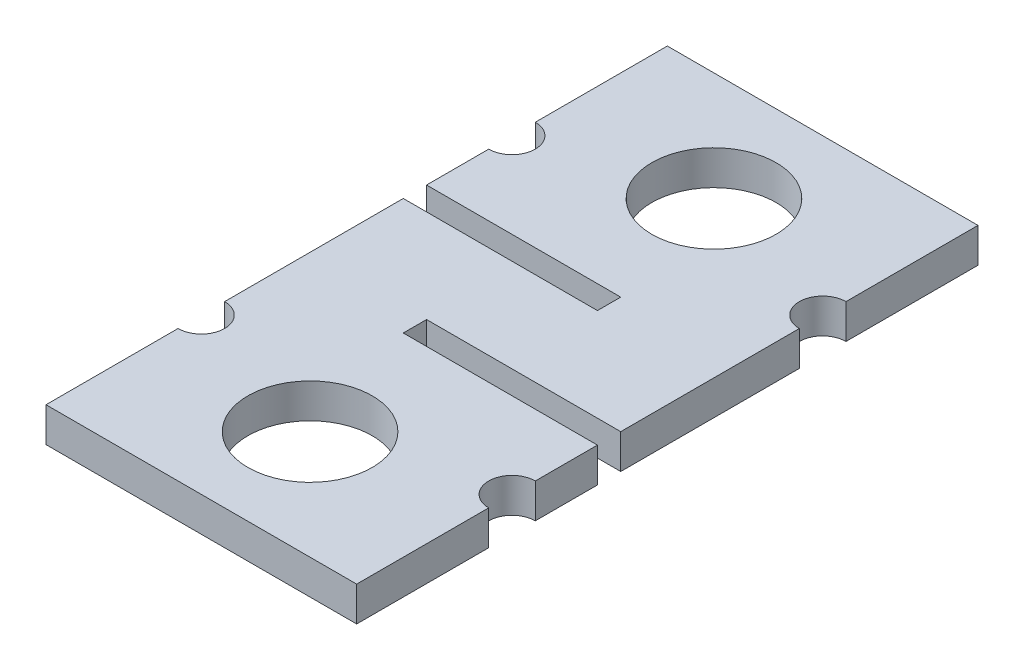
ISO-10303-21;
HEADER;
FILE_DESCRIPTION(('STEP AP214'),'2;1');
FILE_NAME('part.step','',(''),(''),'','','');
FILE_SCHEMA(('AUTOMOTIVE_DESIGN { 1 0 10303 214 1 1 1 1 }'));
ENDSEC;
DATA;
#1=APPLICATION_CONTEXT('core data for automotive mechanical design processes');
#2=APPLICATION_PROTOCOL_DEFINITION('international standard','automotive_design',2000,#1);
#3=PRODUCT_CONTEXT('',#1,'mechanical');
#4=PRODUCT('Part','Part','',(#3));
#5=PRODUCT_RELATED_PRODUCT_CATEGORY('part','',(#4));
#6=PRODUCT_DEFINITION_FORMATION('','',#4);
#7=PRODUCT_DEFINITION_CONTEXT('part definition',#1,'design');
#8=PRODUCT_DEFINITION('design','',#6,#7);
#9=PRODUCT_DEFINITION_SHAPE('','',#8);
#10=(LENGTH_UNIT() NAMED_UNIT(*) SI_UNIT(.MILLI.,.METRE.));
#11=(NAMED_UNIT(*) PLANE_ANGLE_UNIT() SI_UNIT($,.RADIAN.));
#12=(NAMED_UNIT(*) SI_UNIT($,.STERADIAN.) SOLID_ANGLE_UNIT());
#13=UNCERTAINTY_MEASURE_WITH_UNIT(LENGTH_MEASURE(1.E-05),#10,'distance_accuracy_value','');
#14=(GEOMETRIC_REPRESENTATION_CONTEXT(3) GLOBAL_UNCERTAINTY_ASSIGNED_CONTEXT((#13)) GLOBAL_UNIT_ASSIGNED_CONTEXT((#10,
#11,#12)) REPRESENTATION_CONTEXT('',''));
#15=CARTESIAN_POINT('',(0.,0.,0.));
#16=DIRECTION('',(0.,0.,1.));
#17=DIRECTION('',(1.,0.,0.));
#18=AXIS2_PLACEMENT_3D('',#15,#16,#17);
#19=CARTESIAN_POINT('',(-20.,4.45,-18.75));
#20=DIRECTION('',(0.,1.,0.));
#21=DIRECTION('',(0.,0.,1.));
#22=AXIS2_PLACEMENT_3D('',#19,#20,#21);
#23=PLANE('',#22);
#24=CARTESIAN_POINT('',(0.,4.45,27.25));
#25=DIRECTION('',(0.,1.,0.));
#26=DIRECTION('',(0.,0.,1.));
#27=AXIS2_PLACEMENT_3D('',#24,#25,#26);
#28=CIRCLE('',#27,8.);
#29=CARTESIAN_POINT('',(0.,4.45,35.25));
#30=VERTEX_POINT('',#29);
#31=EDGE_CURVE('E205',#30,#30,#28,.T.);
#32=ORIENTED_EDGE('',*,*,#31,.F.);
#33=EDGE_LOOP('',(#32));
#34=FACE_BOUND('',#33,.T.);
#35=CARTESIAN_POINT('',(-20.,4.45,-18.75));
#36=DIRECTION('',(0.,-1.,0.));
#37=DIRECTION('',(0.,0.,1.));
#38=AXIS2_PLACEMENT_3D('',#35,#36,#37);
#39=CIRCLE('',#38,3.);
#40=CARTESIAN_POINT('',(-20.,4.45,-21.75));
#41=VERTEX_POINT('',#40);
#42=CARTESIAN_POINT('',(-20.,4.45,-15.75));
#43=VERTEX_POINT('',#42);
#44=EDGE_CURVE('E240',#41,#43,#39,.T.);
#45=ORIENTED_EDGE('',*,*,#44,.T.);
#46=DIRECTION('',(0.,0.,1.));
#47=VECTOR('',#46,1.);
#48=CARTESIAN_POINT('',(-20.,4.45,-7.75));
#49=LINE('',#48,#47);
#50=CARTESIAN_POINT('',(-20.,4.45,-7.75));
#51=VERTEX_POINT('',#50);
#52=EDGE_CURVE('E128',#43,#51,#49,.T.);
#53=ORIENTED_EDGE('',*,*,#52,.T.);
#54=DIRECTION('',(1.,0.,0.));
#55=VECTOR('',#54,1.);
#56=CARTESIAN_POINT('',(-20.,4.45,-7.75));
#57=LINE('',#56,#55);
#58=CARTESIAN_POINT('',(5.,4.45,-7.75));
#59=VERTEX_POINT('',#58);
#60=EDGE_CURVE('E291',#51,#59,#57,.T.);
#61=ORIENTED_EDGE('',*,*,#60,.T.);
#62=DIRECTION('',(0.,0.,1.));
#63=VECTOR('',#62,1.);
#64=CARTESIAN_POINT('',(5.,4.45,-7.75));
#65=LINE('',#64,#63);
#66=CARTESIAN_POINT('',(5.,4.45,-4.75));
#67=VERTEX_POINT('',#66);
#68=EDGE_CURVE('E310',#59,#67,#65,.T.);
#69=ORIENTED_EDGE('',*,*,#68,.T.);
#70=DIRECTION('',(-1.,0.,0.));
#71=VECTOR('',#70,1.);
#72=CARTESIAN_POINT('',(-20.,4.45,-4.75));
#73=LINE('',#72,#71);
#74=CARTESIAN_POINT('',(-20.,4.45,-4.75));
#75=VERTEX_POINT('',#74);
#76=EDGE_CURVE('E307',#67,#75,#73,.T.);
#77=ORIENTED_EDGE('',*,*,#76,.T.);
#78=DIRECTION('',(0.,0.,1.));
#79=VECTOR('',#78,1.);
#80=CARTESIAN_POINT('',(-20.,4.45,18.25));
#81=LINE('',#80,#79);
#82=CARTESIAN_POINT('',(-20.,4.45,18.25));
#83=VERTEX_POINT('',#82);
#84=EDGE_CURVE('E309',#75,#83,#81,.T.);
#85=ORIENTED_EDGE('',*,*,#84,.T.);
#86=CARTESIAN_POINT('',(-20.,4.45,21.25));
#87=DIRECTION('',(0.,-1.,0.));
#88=DIRECTION('',(0.,0.,1.));
#89=AXIS2_PLACEMENT_3D('',#86,#87,#88);
#90=CIRCLE('',#89,3.);
#91=CARTESIAN_POINT('',(-20.,4.45,24.25));
#92=VERTEX_POINT('',#91);
#93=EDGE_CURVE('E312',#83,#92,#90,.T.);
#94=ORIENTED_EDGE('',*,*,#93,.T.);
#95=DIRECTION('',(0.,0.,1.));
#96=VECTOR('',#95,1.);
#97=CARTESIAN_POINT('',(-20.,4.45,41.25));
#98=LINE('',#97,#96);
#99=CARTESIAN_POINT('',(-20.,4.45,41.25));
#100=VERTEX_POINT('',#99);
#101=EDGE_CURVE('E318',#92,#100,#98,.T.);
#102=ORIENTED_EDGE('',*,*,#101,.T.);
#103=DIRECTION('',(1.,0.,0.));
#104=VECTOR('',#103,1.);
#105=CARTESIAN_POINT('',(-20.,4.45,41.25));
#106=LINE('',#105,#104);
#107=CARTESIAN_POINT('',(20.,4.45,41.25));
#108=VERTEX_POINT('',#107);
#109=EDGE_CURVE('E320',#100,#108,#106,.T.);
#110=ORIENTED_EDGE('',*,*,#109,.T.);
#111=DIRECTION('',(0.,0.,-1.));
#112=VECTOR('',#111,1.);
#113=CARTESIAN_POINT('',(20.,4.45,41.25));
#114=LINE('',#113,#112);
#115=CARTESIAN_POINT('',(20.,4.45,24.25));
#116=VERTEX_POINT('',#115);
#117=EDGE_CURVE('E322',#108,#116,#114,.T.);
#118=ORIENTED_EDGE('',*,*,#117,.T.);
#119=CARTESIAN_POINT('',(20.,4.45,21.25));
#120=DIRECTION('',(0.,-1.,0.));
#121=DIRECTION('',(0.,0.,1.));
#122=AXIS2_PLACEMENT_3D('',#119,#120,#121);
#123=CIRCLE('',#122,3.);
#124=CARTESIAN_POINT('',(20.,4.45,18.25));
#125=VERTEX_POINT('',#124);
#126=EDGE_CURVE('E324',#116,#125,#123,.T.);
#127=ORIENTED_EDGE('',*,*,#126,.T.);
#128=DIRECTION('',(0.,0.,-1.));
#129=VECTOR('',#128,1.);
#130=CARTESIAN_POINT('',(20.,4.45,18.25));
#131=LINE('',#130,#129);
#132=CARTESIAN_POINT('',(20.,4.45,10.25));
#133=VERTEX_POINT('',#132);
#134=EDGE_CURVE('E326',#125,#133,#131,.T.);
#135=ORIENTED_EDGE('',*,*,#134,.T.);
#136=DIRECTION('',(-1.,0.,0.));
#137=VECTOR('',#136,1.);
#138=CARTESIAN_POINT('',(20.,4.45,10.25));
#139=LINE('',#138,#137);
#140=CARTESIAN_POINT('',(-5.,4.45,10.25));
#141=VERTEX_POINT('',#140);
#142=EDGE_CURVE('E328',#133,#141,#139,.T.);
#143=ORIENTED_EDGE('',*,*,#142,.T.);
#144=DIRECTION('',(0.,0.,-1.));
#145=VECTOR('',#144,1.);
#146=CARTESIAN_POINT('',(-5.,4.45,10.25));
#147=LINE('',#146,#145);
#148=CARTESIAN_POINT('',(-5.,4.45,7.25));
#149=VERTEX_POINT('',#148);
#150=EDGE_CURVE('E330',#141,#149,#147,.T.);
#151=ORIENTED_EDGE('',*,*,#150,.T.);
#152=DIRECTION('',(1.,0.,0.));
#153=VECTOR('',#152,1.);
#154=CARTESIAN_POINT('',(20.,4.45,7.25));
#155=LINE('',#154,#153);
#156=CARTESIAN_POINT('',(20.,4.45,7.25));
#157=VERTEX_POINT('',#156);
#158=EDGE_CURVE('E332',#149,#157,#155,.T.);
#159=ORIENTED_EDGE('',*,*,#158,.T.);
#160=DIRECTION('',(0.,0.,-1.));
#161=VECTOR('',#160,1.);
#162=CARTESIAN_POINT('',(20.,4.45,7.25));
#163=LINE('',#162,#161);
#164=CARTESIAN_POINT('',(20.,4.45,-15.75));
#165=VERTEX_POINT('',#164);
#166=EDGE_CURVE('E334',#157,#165,#163,.T.);
#167=ORIENTED_EDGE('',*,*,#166,.T.);
#168=CARTESIAN_POINT('',(20.,4.45,-18.75));
#169=DIRECTION('',(0.,-1.,0.));
#170=DIRECTION('',(0.,0.,1.));
#171=AXIS2_PLACEMENT_3D('',#168,#169,#170);
#172=CIRCLE('',#171,3.);
#173=CARTESIAN_POINT('',(20.,4.45,-21.75));
#174=VERTEX_POINT('',#173);
#175=EDGE_CURVE('E183',#165,#174,#172,.T.);
#176=ORIENTED_EDGE('',*,*,#175,.T.);
#177=DIRECTION('',(0.,0.,-1.));
#178=VECTOR('',#177,1.);
#179=CARTESIAN_POINT('',(20.,4.45,-21.75));
#180=LINE('',#179,#178);
#181=CARTESIAN_POINT('',(20.,4.45,-38.75));
#182=VERTEX_POINT('',#181);
#183=EDGE_CURVE('E177',#174,#182,#180,.T.);
#184=ORIENTED_EDGE('',*,*,#183,.T.);
#185=DIRECTION('',(-1.,0.,0.));
#186=VECTOR('',#185,1.);
#187=CARTESIAN_POINT('',(-20.,4.45,-38.75));
#188=LINE('',#187,#186);
#189=CARTESIAN_POINT('',(-20.,4.45,-38.75));
#190=VERTEX_POINT('',#189);
#191=EDGE_CURVE('E181',#182,#190,#188,.T.);
#192=ORIENTED_EDGE('',*,*,#191,.T.);
#193=DIRECTION('',(0.,0.,1.));
#194=VECTOR('',#193,1.);
#195=CARTESIAN_POINT('',(-20.,4.45,-21.75));
#196=LINE('',#195,#194);
#197=EDGE_CURVE('E49',#190,#41,#196,.T.);
#198=ORIENTED_EDGE('',*,*,#197,.T.);
#199=EDGE_LOOP('',(#45,#53,#61,#69,#77,#85,#94,#102,#110,#118,#127,#135,#143,#151,#159,#167,
#176,#184,#192,#198));
#200=FACE_BOUND('',#199,.T.);
#201=CARTESIAN_POINT('',(0.,4.45,-24.75));
#202=DIRECTION('',(0.,1.,0.));
#203=DIRECTION('',(0.,0.,1.));
#204=AXIS2_PLACEMENT_3D('',#201,#202,#203);
#205=CIRCLE('',#204,8.00000000000001);
#206=CARTESIAN_POINT('',(0.,4.45,-16.75));
#207=VERTEX_POINT('',#206);
#208=EDGE_CURVE('E376',#207,#207,#205,.T.);
#209=ORIENTED_EDGE('',*,*,#208,.F.);
#210=EDGE_LOOP('',(#209));
#211=FACE_BOUND('',#210,.T.);
#212=ADVANCED_FACE('F32',(#34,#200,#211),#23,.T.);
#213=CARTESIAN_POINT('',(-20.,0.,-18.75));
#214=DIRECTION('',(0.,1.,0.));
#215=DIRECTION('',(0.,0.,1.));
#216=AXIS2_PLACEMENT_3D('',#213,#214,#215);
#217=PLANE('',#216);
#218=CARTESIAN_POINT('',(-20.,0.,-18.75));
#219=DIRECTION('',(0.,-1.,0.));
#220=DIRECTION('',(0.,0.,1.));
#221=AXIS2_PLACEMENT_3D('',#218,#219,#220);
#222=CIRCLE('',#221,3.);
#223=CARTESIAN_POINT('',(-20.,0.,-21.75));
#224=VERTEX_POINT('',#223);
#225=CARTESIAN_POINT('',(-20.,0.,-15.75));
#226=VERTEX_POINT('',#225);
#227=EDGE_CURVE('E201',#224,#226,#222,.T.);
#228=ORIENTED_EDGE('',*,*,#227,.F.);
#229=DIRECTION('',(0.,0.,1.));
#230=VECTOR('',#229,1.);
#231=CARTESIAN_POINT('',(-20.,0.,-21.75));
#232=LINE('',#231,#230);
#233=CARTESIAN_POINT('',(-20.,0.,-38.75));
#234=VERTEX_POINT('',#233);
#235=EDGE_CURVE('E120',#234,#224,#232,.T.);
#236=ORIENTED_EDGE('',*,*,#235,.F.);
#237=DIRECTION('',(-1.,0.,0.));
#238=VECTOR('',#237,1.);
#239=CARTESIAN_POINT('',(-20.,0.,-38.75));
#240=LINE('',#239,#238);
#241=CARTESIAN_POINT('',(20.,0.,-38.75));
#242=VERTEX_POINT('',#241);
#243=EDGE_CURVE('E114',#242,#234,#240,.T.);
#244=ORIENTED_EDGE('',*,*,#243,.F.);
#245=DIRECTION('',(0.,0.,-1.));
#246=VECTOR('',#245,1.);
#247=CARTESIAN_POINT('',(20.,0.,-21.75));
#248=LINE('',#247,#246);
#249=CARTESIAN_POINT('',(20.,0.,-21.75));
#250=VERTEX_POINT('',#249);
#251=EDGE_CURVE('E191',#250,#242,#248,.T.);
#252=ORIENTED_EDGE('',*,*,#251,.F.);
#253=CARTESIAN_POINT('',(20.,0.,-18.75));
#254=DIRECTION('',(0.,-1.,0.));
#255=DIRECTION('',(0.,0.,1.));
#256=AXIS2_PLACEMENT_3D('',#253,#254,#255);
#257=CIRCLE('',#256,3.);
#258=CARTESIAN_POINT('',(20.,0.,-15.75));
#259=VERTEX_POINT('',#258);
#260=EDGE_CURVE('E235',#259,#250,#257,.T.);
#261=ORIENTED_EDGE('',*,*,#260,.F.);
#262=DIRECTION('',(0.,0.,-1.));
#263=VECTOR('',#262,1.);
#264=CARTESIAN_POINT('',(20.,0.,7.25));
#265=LINE('',#264,#263);
#266=CARTESIAN_POINT('',(20.,0.,7.25));
#267=VERTEX_POINT('',#266);
#268=EDGE_CURVE('E233',#267,#259,#265,.T.);
#269=ORIENTED_EDGE('',*,*,#268,.F.);
#270=DIRECTION('',(1.,0.,0.));
#271=VECTOR('',#270,1.);
#272=CARTESIAN_POINT('',(20.,0.,7.25));
#273=LINE('',#272,#271);
#274=CARTESIAN_POINT('',(-5.,0.,7.25));
#275=VERTEX_POINT('',#274);
#276=EDGE_CURVE('E231',#275,#267,#273,.T.);
#277=ORIENTED_EDGE('',*,*,#276,.F.);
#278=DIRECTION('',(0.,0.,-1.));
#279=VECTOR('',#278,1.);
#280=CARTESIAN_POINT('',(-5.,0.,10.25));
#281=LINE('',#280,#279);
#282=CARTESIAN_POINT('',(-5.,0.,10.25));
#283=VERTEX_POINT('',#282);
#284=EDGE_CURVE('E229',#283,#275,#281,.T.);
#285=ORIENTED_EDGE('',*,*,#284,.F.);
#286=DIRECTION('',(-1.,0.,0.));
#287=VECTOR('',#286,1.);
#288=CARTESIAN_POINT('',(20.,0.,10.25));
#289=LINE('',#288,#287);
#290=CARTESIAN_POINT('',(20.,0.,10.25));
#291=VERTEX_POINT('',#290);
#292=EDGE_CURVE('E227',#291,#283,#289,.T.);
#293=ORIENTED_EDGE('',*,*,#292,.F.);
#294=DIRECTION('',(0.,0.,-1.));
#295=VECTOR('',#294,1.);
#296=CARTESIAN_POINT('',(20.,0.,18.25));
#297=LINE('',#296,#295);
#298=CARTESIAN_POINT('',(20.,0.,18.25));
#299=VERTEX_POINT('',#298);
#300=EDGE_CURVE('E225',#299,#291,#297,.T.);
#301=ORIENTED_EDGE('',*,*,#300,.F.);
#302=CARTESIAN_POINT('',(20.,0.,21.25));
#303=DIRECTION('',(0.,-1.,0.));
#304=DIRECTION('',(0.,0.,1.));
#305=AXIS2_PLACEMENT_3D('',#302,#303,#304);
#306=CIRCLE('',#305,3.);
#307=CARTESIAN_POINT('',(20.,0.,24.25));
#308=VERTEX_POINT('',#307);
#309=EDGE_CURVE('E223',#308,#299,#306,.T.);
#310=ORIENTED_EDGE('',*,*,#309,.F.);
#311=DIRECTION('',(0.,0.,-1.));
#312=VECTOR('',#311,1.);
#313=CARTESIAN_POINT('',(20.,0.,41.25));
#314=LINE('',#313,#312);
#315=CARTESIAN_POINT('',(20.,0.,41.25));
#316=VERTEX_POINT('',#315);
#317=EDGE_CURVE('E221',#316,#308,#314,.T.);
#318=ORIENTED_EDGE('',*,*,#317,.F.);
#319=DIRECTION('',(1.,0.,0.));
#320=VECTOR('',#319,1.);
#321=CARTESIAN_POINT('',(-20.,0.,41.25));
#322=LINE('',#321,#320);
#323=CARTESIAN_POINT('',(-20.,0.,41.25));
#324=VERTEX_POINT('',#323);
#325=EDGE_CURVE('E219',#324,#316,#322,.T.);
#326=ORIENTED_EDGE('',*,*,#325,.F.);
#327=DIRECTION('',(0.,0.,1.));
#328=VECTOR('',#327,1.);
#329=CARTESIAN_POINT('',(-20.,0.,41.25));
#330=LINE('',#329,#328);
#331=CARTESIAN_POINT('',(-20.,0.,24.25));
#332=VERTEX_POINT('',#331);
#333=EDGE_CURVE('E217',#332,#324,#330,.T.);
#334=ORIENTED_EDGE('',*,*,#333,.F.);
#335=CARTESIAN_POINT('',(-20.,0.,21.25));
#336=DIRECTION('',(0.,-1.,0.));
#337=DIRECTION('',(0.,0.,1.));
#338=AXIS2_PLACEMENT_3D('',#335,#336,#337);
#339=CIRCLE('',#338,3.);
#340=CARTESIAN_POINT('',(-20.,0.,18.25));
#341=VERTEX_POINT('',#340);
#342=EDGE_CURVE('E215',#341,#332,#339,.T.);
#343=ORIENTED_EDGE('',*,*,#342,.F.);
#344=DIRECTION('',(0.,0.,1.));
#345=VECTOR('',#344,1.);
#346=CARTESIAN_POINT('',(-20.,0.,18.25));
#347=LINE('',#346,#345);
#348=CARTESIAN_POINT('',(-20.,0.,-4.75));
#349=VERTEX_POINT('',#348);
#350=EDGE_CURVE('E213',#349,#341,#347,.T.);
#351=ORIENTED_EDGE('',*,*,#350,.F.);
#352=DIRECTION('',(-1.,0.,0.));
#353=VECTOR('',#352,1.);
#354=CARTESIAN_POINT('',(-20.,0.,-4.75));
#355=LINE('',#354,#353);
#356=CARTESIAN_POINT('',(5.,0.,-4.75));
#357=VERTEX_POINT('',#356);
#358=EDGE_CURVE('E211',#357,#349,#355,.T.);
#359=ORIENTED_EDGE('',*,*,#358,.F.);
#360=DIRECTION('',(0.,0.,1.));
#361=VECTOR('',#360,1.);
#362=CARTESIAN_POINT('',(5.,0.,-7.75));
#363=LINE('',#362,#361);
#364=CARTESIAN_POINT('',(5.,0.,-7.75));
#365=VERTEX_POINT('',#364);
#366=EDGE_CURVE('E209',#365,#357,#363,.T.);
#367=ORIENTED_EDGE('',*,*,#366,.F.);
#368=DIRECTION('',(1.,0.,0.));
#369=VECTOR('',#368,1.);
#370=CARTESIAN_POINT('',(-20.,0.,-7.75));
#371=LINE('',#370,#369);
#372=CARTESIAN_POINT('',(-20.,0.,-7.75));
#373=VERTEX_POINT('',#372);
#374=EDGE_CURVE('E207',#373,#365,#371,.T.);
#375=ORIENTED_EDGE('',*,*,#374,.F.);
#376=DIRECTION('',(0.,0.,1.));
#377=VECTOR('',#376,1.);
#378=CARTESIAN_POINT('',(-20.,0.,-7.75));
#379=LINE('',#378,#377);
#380=EDGE_CURVE('E204',#226,#373,#379,.T.);
#381=ORIENTED_EDGE('',*,*,#380,.F.);
#382=EDGE_LOOP('',(#228,#236,#244,#252,#261,#269,#277,#285,#293,#301,#310,#318,#326,#334,#343,
#351,#359,#367,#375,#381));
#383=FACE_BOUND('',#382,.T.);
#384=CARTESIAN_POINT('',(0.,0.,27.25));
#385=DIRECTION('',(0.,1.,0.));
#386=DIRECTION('',(0.,0.,1.));
#387=AXIS2_PLACEMENT_3D('',#384,#385,#386);
#388=CIRCLE('',#387,8.);
#389=CARTESIAN_POINT('',(0.,0.,35.25));
#390=VERTEX_POINT('',#389);
#391=EDGE_CURVE('E382',#390,#390,#388,.T.);
#392=ORIENTED_EDGE('',*,*,#391,.T.);
#393=EDGE_LOOP('',(#392));
#394=FACE_BOUND('',#393,.T.);
#395=CARTESIAN_POINT('',(0.,0.,-24.75));
#396=DIRECTION('',(0.,1.,0.));
#397=DIRECTION('',(0.,0.,1.));
#398=AXIS2_PLACEMENT_3D('',#395,#396,#397);
#399=CIRCLE('',#398,8.00000000000001);
#400=CARTESIAN_POINT('',(0.,0.,-16.75));
#401=VERTEX_POINT('',#400);
#402=EDGE_CURVE('E379',#401,#401,#399,.T.);
#403=ORIENTED_EDGE('',*,*,#402,.T.);
#404=EDGE_LOOP('',(#403));
#405=FACE_BOUND('',#404,.T.);
#406=ADVANCED_FACE('F295',(#383,#394,#405),#217,.F.);
#407=CARTESIAN_POINT('',(-20.,4.45,-18.75));
#408=DIRECTION('',(0.,-1.,0.));
#409=DIRECTION('',(0.,0.,-1.));
#410=AXIS2_PLACEMENT_3D('',#407,#408,#409);
#411=CYLINDRICAL_SURFACE('',#410,3.);
#412=ORIENTED_EDGE('',*,*,#227,.T.);
#413=DIRECTION('',(0.,-1.,0.));
#414=VECTOR('',#413,1.);
#415=CARTESIAN_POINT('',(-20.,4.45,-15.75));
#416=LINE('',#415,#414);
#417=EDGE_CURVE('E11',#43,#226,#416,.T.);
#418=ORIENTED_EDGE('',*,*,#417,.F.);
#419=ORIENTED_EDGE('',*,*,#44,.F.);
#420=DIRECTION('',(0.,-1.,0.));
#421=VECTOR('',#420,1.);
#422=CARTESIAN_POINT('',(-20.,4.45,-21.75));
#423=LINE('',#422,#421);
#424=EDGE_CURVE('E197',#41,#224,#423,.T.);
#425=ORIENTED_EDGE('',*,*,#424,.T.);
#426=EDGE_LOOP('',(#412,#418,#419,#425));
#427=FACE_BOUND('',#426,.T.);
#428=ADVANCED_FACE('F34',(#427),#411,.F.);
#429=CARTESIAN_POINT('',(-20.,4.45,-7.75));
#430=DIRECTION('',(1.,0.,0.));
#431=DIRECTION('',(0.,0.,-1.));
#432=AXIS2_PLACEMENT_3D('',#429,#430,#431);
#433=PLANE('',#432);
#434=ORIENTED_EDGE('',*,*,#380,.T.);
#435=DIRECTION('',(0.,-1.,0.));
#436=VECTOR('',#435,1.);
#437=CARTESIAN_POINT('',(-20.,4.45,-7.75));
#438=LINE('',#437,#436);
#439=EDGE_CURVE('E41',#51,#373,#438,.T.);
#440=ORIENTED_EDGE('',*,*,#439,.F.);
#441=ORIENTED_EDGE('',*,*,#52,.F.);
#442=ORIENTED_EDGE('',*,*,#417,.T.);
#443=EDGE_LOOP('',(#434,#440,#441,#442));
#444=FACE_BOUND('',#443,.T.);
#445=ADVANCED_FACE('F555',(#444),#433,.F.);
#446=CARTESIAN_POINT('',(-20.,4.45,-7.75));
#447=DIRECTION('',(0.,0.,-1.));
#448=DIRECTION('',(-1.,0.,0.));
#449=AXIS2_PLACEMENT_3D('',#446,#447,#448);
#450=PLANE('',#449);
#451=ORIENTED_EDGE('',*,*,#374,.T.);
#452=DIRECTION('',(0.,-1.,0.));
#453=VECTOR('',#452,1.);
#454=CARTESIAN_POINT('',(5.,4.45,-7.75));
#455=LINE('',#454,#453);
#456=EDGE_CURVE('E283',#59,#365,#455,.T.);
#457=ORIENTED_EDGE('',*,*,#456,.F.);
#458=ORIENTED_EDGE('',*,*,#60,.F.);
#459=ORIENTED_EDGE('',*,*,#439,.T.);
#460=EDGE_LOOP('',(#451,#457,#458,#459));
#461=FACE_BOUND('',#460,.T.);
#462=ADVANCED_FACE('F289',(#461),#450,.F.);
#463=CARTESIAN_POINT('',(5.,4.45,-7.75));
#464=DIRECTION('',(1.,0.,0.));
#465=DIRECTION('',(0.,0.,-1.));
#466=AXIS2_PLACEMENT_3D('',#463,#464,#465);
#467=PLANE('',#466);
#468=ORIENTED_EDGE('',*,*,#366,.T.);
#469=DIRECTION('',(0.,-1.,0.));
#470=VECTOR('',#469,1.);
#471=CARTESIAN_POINT('',(5.,4.45,-4.75));
#472=LINE('',#471,#470);
#473=EDGE_CURVE('E280',#67,#357,#472,.T.);
#474=ORIENTED_EDGE('',*,*,#473,.F.);
#475=ORIENTED_EDGE('',*,*,#68,.F.);
#476=ORIENTED_EDGE('',*,*,#456,.T.);
#477=EDGE_LOOP('',(#468,#474,#475,#476));
#478=FACE_BOUND('',#477,.T.);
#479=ADVANCED_FACE('F301',(#478),#467,.F.);
#480=CARTESIAN_POINT('',(-20.,4.45,-4.75));
#481=DIRECTION('',(0.,0.,1.));
#482=DIRECTION('',(1.,0.,0.));
#483=AXIS2_PLACEMENT_3D('',#480,#481,#482);
#484=PLANE('',#483);
#485=ORIENTED_EDGE('',*,*,#358,.T.);
#486=DIRECTION('',(0.,-1.,0.));
#487=VECTOR('',#486,1.);
#488=CARTESIAN_POINT('',(-20.,4.45,-4.75));
#489=LINE('',#488,#487);
#490=EDGE_CURVE('E277',#75,#349,#489,.T.);
#491=ORIENTED_EDGE('',*,*,#490,.F.);
#492=ORIENTED_EDGE('',*,*,#76,.F.);
#493=ORIENTED_EDGE('',*,*,#473,.T.);
#494=EDGE_LOOP('',(#485,#491,#492,#493));
#495=FACE_BOUND('',#494,.T.);
#496=ADVANCED_FACE('F305',(#495),#484,.F.);
#497=CARTESIAN_POINT('',(-20.,4.45,18.25));
#498=DIRECTION('',(1.,0.,0.));
#499=DIRECTION('',(0.,0.,-1.));
#500=AXIS2_PLACEMENT_3D('',#497,#498,#499);
#501=PLANE('',#500);
#502=ORIENTED_EDGE('',*,*,#350,.T.);
#503=DIRECTION('',(0.,-1.,0.));
#504=VECTOR('',#503,1.);
#505=CARTESIAN_POINT('',(-20.,4.45,18.25));
#506=LINE('',#505,#504);
#507=EDGE_CURVE('E274',#83,#341,#506,.T.);
#508=ORIENTED_EDGE('',*,*,#507,.F.);
#509=ORIENTED_EDGE('',*,*,#84,.F.);
#510=ORIENTED_EDGE('',*,*,#490,.T.);
#511=EDGE_LOOP('',(#502,#508,#509,#510));
#512=FACE_BOUND('',#511,.T.);
#513=ADVANCED_FACE('F520',(#512),#501,.F.);
#514=CARTESIAN_POINT('',(-20.,4.45,21.25));
#515=DIRECTION('',(0.,-1.,0.));
#516=DIRECTION('',(0.,0.,-1.));
#517=AXIS2_PLACEMENT_3D('',#514,#515,#516);
#518=CYLINDRICAL_SURFACE('',#517,3.);
#519=ORIENTED_EDGE('',*,*,#342,.T.);
#520=DIRECTION('',(0.,-1.,0.));
#521=VECTOR('',#520,1.);
#522=CARTESIAN_POINT('',(-20.,4.45,24.25));
#523=LINE('',#522,#521);
#524=EDGE_CURVE('E271',#92,#332,#523,.T.);
#525=ORIENTED_EDGE('',*,*,#524,.F.);
#526=ORIENTED_EDGE('',*,*,#93,.F.);
#527=ORIENTED_EDGE('',*,*,#507,.T.);
#528=EDGE_LOOP('',(#519,#525,#526,#527));
#529=FACE_BOUND('',#528,.T.);
#530=ADVANCED_FACE('F510',(#529),#518,.F.);
#531=CARTESIAN_POINT('',(-20.,4.45,41.25));
#532=DIRECTION('',(1.,0.,0.));
#533=DIRECTION('',(0.,0.,-1.));
#534=AXIS2_PLACEMENT_3D('',#531,#532,#533);
#535=PLANE('',#534);
#536=ORIENTED_EDGE('',*,*,#333,.T.);
#537=DIRECTION('',(0.,-1.,0.));
#538=VECTOR('',#537,1.);
#539=CARTESIAN_POINT('',(-20.,4.45,41.25));
#540=LINE('',#539,#538);
#541=EDGE_CURVE('E268',#100,#324,#540,.T.);
#542=ORIENTED_EDGE('',*,*,#541,.F.);
#543=ORIENTED_EDGE('',*,*,#101,.F.);
#544=ORIENTED_EDGE('',*,*,#524,.T.);
#545=EDGE_LOOP('',(#536,#542,#543,#544));
#546=FACE_BOUND('',#545,.T.);
#547=ADVANCED_FACE('F500',(#546),#535,.F.);
#548=CARTESIAN_POINT('',(-20.,4.45,41.25));
#549=DIRECTION('',(0.,0.,-1.));
#550=DIRECTION('',(-1.,0.,0.));
#551=AXIS2_PLACEMENT_3D('',#548,#549,#550);
#552=PLANE('',#551);
#553=ORIENTED_EDGE('',*,*,#325,.T.);
#554=DIRECTION('',(0.,-1.,0.));
#555=VECTOR('',#554,1.);
#556=CARTESIAN_POINT('',(20.,4.45,41.25));
#557=LINE('',#556,#555);
#558=EDGE_CURVE('E265',#108,#316,#557,.T.);
#559=ORIENTED_EDGE('',*,*,#558,.F.);
#560=ORIENTED_EDGE('',*,*,#109,.F.);
#561=ORIENTED_EDGE('',*,*,#541,.T.);
#562=EDGE_LOOP('',(#553,#559,#560,#561));
#563=FACE_BOUND('',#562,.T.);
#564=ADVANCED_FACE('F490',(#563),#552,.F.);
#565=CARTESIAN_POINT('',(20.,4.45,41.25));
#566=DIRECTION('',(-1.,0.,0.));
#567=DIRECTION('',(0.,0.,1.));
#568=AXIS2_PLACEMENT_3D('',#565,#566,#567);
#569=PLANE('',#568);
#570=ORIENTED_EDGE('',*,*,#317,.T.);
#571=DIRECTION('',(0.,-1.,0.));
#572=VECTOR('',#571,1.);
#573=CARTESIAN_POINT('',(20.,4.45,24.25));
#574=LINE('',#573,#572);
#575=EDGE_CURVE('E262',#116,#308,#574,.T.);
#576=ORIENTED_EDGE('',*,*,#575,.F.);
#577=ORIENTED_EDGE('',*,*,#117,.F.);
#578=ORIENTED_EDGE('',*,*,#558,.T.);
#579=EDGE_LOOP('',(#570,#576,#577,#578));
#580=FACE_BOUND('',#579,.T.);
#581=ADVANCED_FACE('F480',(#580),#569,.F.);
#582=CARTESIAN_POINT('',(20.,4.45,21.25));
#583=DIRECTION('',(0.,-1.,0.));
#584=DIRECTION('',(0.,0.,-1.));
#585=AXIS2_PLACEMENT_3D('',#582,#583,#584);
#586=CYLINDRICAL_SURFACE('',#585,3.);
#587=ORIENTED_EDGE('',*,*,#309,.T.);
#588=DIRECTION('',(0.,-1.,0.));
#589=VECTOR('',#588,1.);
#590=CARTESIAN_POINT('',(20.,4.45,18.25));
#591=LINE('',#590,#589);
#592=EDGE_CURVE('E259',#125,#299,#591,.T.);
#593=ORIENTED_EDGE('',*,*,#592,.F.);
#594=ORIENTED_EDGE('',*,*,#126,.F.);
#595=ORIENTED_EDGE('',*,*,#575,.T.);
#596=EDGE_LOOP('',(#587,#593,#594,#595));
#597=FACE_BOUND('',#596,.T.);
#598=ADVANCED_FACE('F470',(#597),#586,.F.);
#599=CARTESIAN_POINT('',(20.,4.45,18.25));
#600=DIRECTION('',(-1.,0.,0.));
#601=DIRECTION('',(0.,0.,1.));
#602=AXIS2_PLACEMENT_3D('',#599,#600,#601);
#603=PLANE('',#602);
#604=ORIENTED_EDGE('',*,*,#300,.T.);
#605=DIRECTION('',(0.,-1.,0.));
#606=VECTOR('',#605,1.);
#607=CARTESIAN_POINT('',(20.,4.45,10.25));
#608=LINE('',#607,#606);
#609=EDGE_CURVE('E256',#133,#291,#608,.T.);
#610=ORIENTED_EDGE('',*,*,#609,.F.);
#611=ORIENTED_EDGE('',*,*,#134,.F.);
#612=ORIENTED_EDGE('',*,*,#592,.T.);
#613=EDGE_LOOP('',(#604,#610,#611,#612));
#614=FACE_BOUND('',#613,.T.);
#615=ADVANCED_FACE('F460',(#614),#603,.F.);
#616=CARTESIAN_POINT('',(20.,4.45,10.25));
#617=DIRECTION('',(0.,0.,1.));
#618=DIRECTION('',(1.,0.,0.));
#619=AXIS2_PLACEMENT_3D('',#616,#617,#618);
#620=PLANE('',#619);
#621=ORIENTED_EDGE('',*,*,#292,.T.);
#622=DIRECTION('',(0.,-1.,0.));
#623=VECTOR('',#622,1.);
#624=CARTESIAN_POINT('',(-5.,4.45,10.25));
#625=LINE('',#624,#623);
#626=EDGE_CURVE('E253',#141,#283,#625,.T.);
#627=ORIENTED_EDGE('',*,*,#626,.F.);
#628=ORIENTED_EDGE('',*,*,#142,.F.);
#629=ORIENTED_EDGE('',*,*,#609,.T.);
#630=EDGE_LOOP('',(#621,#627,#628,#629));
#631=FACE_BOUND('',#630,.T.);
#632=ADVANCED_FACE('F450',(#631),#620,.F.);
#633=CARTESIAN_POINT('',(-5.,4.45,10.25));
#634=DIRECTION('',(-1.,0.,0.));
#635=DIRECTION('',(0.,0.,1.));
#636=AXIS2_PLACEMENT_3D('',#633,#634,#635);
#637=PLANE('',#636);
#638=ORIENTED_EDGE('',*,*,#284,.T.);
#639=DIRECTION('',(0.,-1.,0.));
#640=VECTOR('',#639,1.);
#641=CARTESIAN_POINT('',(-5.,4.45,7.25));
#642=LINE('',#641,#640);
#643=EDGE_CURVE('E250',#149,#275,#642,.T.);
#644=ORIENTED_EDGE('',*,*,#643,.F.);
#645=ORIENTED_EDGE('',*,*,#150,.F.);
#646=ORIENTED_EDGE('',*,*,#626,.T.);
#647=EDGE_LOOP('',(#638,#644,#645,#646));
#648=FACE_BOUND('',#647,.T.);
#649=ADVANCED_FACE('F440',(#648),#637,.F.);
#650=CARTESIAN_POINT('',(20.,4.45,7.25));
#651=DIRECTION('',(0.,0.,-1.));
#652=DIRECTION('',(-1.,0.,0.));
#653=AXIS2_PLACEMENT_3D('',#650,#651,#652);
#654=PLANE('',#653);
#655=ORIENTED_EDGE('',*,*,#276,.T.);
#656=DIRECTION('',(0.,-1.,0.));
#657=VECTOR('',#656,1.);
#658=CARTESIAN_POINT('',(20.,4.45,7.25));
#659=LINE('',#658,#657);
#660=EDGE_CURVE('E247',#157,#267,#659,.T.);
#661=ORIENTED_EDGE('',*,*,#660,.F.);
#662=ORIENTED_EDGE('',*,*,#158,.F.);
#663=ORIENTED_EDGE('',*,*,#643,.T.);
#664=EDGE_LOOP('',(#655,#661,#662,#663));
#665=FACE_BOUND('',#664,.T.);
#666=ADVANCED_FACE('F431',(#665),#654,.F.);
#667=CARTESIAN_POINT('',(20.,4.45,7.25));
#668=DIRECTION('',(-1.,0.,0.));
#669=DIRECTION('',(0.,0.,1.));
#670=AXIS2_PLACEMENT_3D('',#667,#668,#669);
#671=PLANE('',#670);
#672=ORIENTED_EDGE('',*,*,#268,.T.);
#673=DIRECTION('',(0.,-1.,0.));
#674=VECTOR('',#673,1.);
#675=CARTESIAN_POINT('',(20.,4.45,-15.75));
#676=LINE('',#675,#674);
#677=EDGE_CURVE('E244',#165,#259,#676,.T.);
#678=ORIENTED_EDGE('',*,*,#677,.F.);
#679=ORIENTED_EDGE('',*,*,#166,.F.);
#680=ORIENTED_EDGE('',*,*,#660,.T.);
#681=EDGE_LOOP('',(#672,#678,#679,#680));
#682=FACE_BOUND('',#681,.T.);
#683=ADVANCED_FACE('F340',(#682),#671,.F.);
#684=CARTESIAN_POINT('',(20.,4.45,-18.75));
#685=DIRECTION('',(0.,-1.,0.));
#686=DIRECTION('',(0.,0.,-1.));
#687=AXIS2_PLACEMENT_3D('',#684,#685,#686);
#688=CYLINDRICAL_SURFACE('',#687,3.);
#689=ORIENTED_EDGE('',*,*,#260,.T.);
#690=DIRECTION('',(0.,-1.,0.));
#691=VECTOR('',#690,1.);
#692=CARTESIAN_POINT('',(20.,4.45,-21.75));
#693=LINE('',#692,#691);
#694=EDGE_CURVE('E192',#174,#250,#693,.T.);
#695=ORIENTED_EDGE('',*,*,#694,.F.);
#696=ORIENTED_EDGE('',*,*,#175,.F.);
#697=ORIENTED_EDGE('',*,*,#677,.T.);
#698=EDGE_LOOP('',(#689,#695,#696,#697));
#699=FACE_BOUND('',#698,.T.);
#700=ADVANCED_FACE('F344',(#699),#688,.F.);
#701=CARTESIAN_POINT('',(20.,4.45,-21.75));
#702=DIRECTION('',(-1.,0.,0.));
#703=DIRECTION('',(0.,0.,1.));
#704=AXIS2_PLACEMENT_3D('',#701,#702,#703);
#705=PLANE('',#704);
#706=ORIENTED_EDGE('',*,*,#251,.T.);
#707=DIRECTION('',(0.,-1.,0.));
#708=VECTOR('',#707,1.);
#709=CARTESIAN_POINT('',(20.,4.45,-38.75));
#710=LINE('',#709,#708);
#711=EDGE_CURVE('E188',#182,#242,#710,.T.);
#712=ORIENTED_EDGE('',*,*,#711,.F.);
#713=ORIENTED_EDGE('',*,*,#183,.F.);
#714=ORIENTED_EDGE('',*,*,#694,.T.);
#715=EDGE_LOOP('',(#706,#712,#713,#714));
#716=FACE_BOUND('',#715,.T.);
#717=ADVANCED_FACE('F189',(#716),#705,.F.);
#718=CARTESIAN_POINT('',(-20.,4.45,-38.75));
#719=DIRECTION('',(0.,0.,1.));
#720=DIRECTION('',(1.,0.,0.));
#721=AXIS2_PLACEMENT_3D('',#718,#719,#720);
#722=PLANE('',#721);
#723=ORIENTED_EDGE('',*,*,#243,.T.);
#724=DIRECTION('',(0.,-1.,0.));
#725=VECTOR('',#724,1.);
#726=CARTESIAN_POINT('',(-20.,4.45,-38.75));
#727=LINE('',#726,#725);
#728=EDGE_CURVE('E193',#190,#234,#727,.T.);
#729=ORIENTED_EDGE('',*,*,#728,.F.);
#730=ORIENTED_EDGE('',*,*,#191,.F.);
#731=ORIENTED_EDGE('',*,*,#711,.T.);
#732=EDGE_LOOP('',(#723,#729,#730,#731));
#733=FACE_BOUND('',#732,.T.);
#734=ADVANCED_FACE('F195',(#733),#722,.F.);
#735=CARTESIAN_POINT('',(-20.,4.45,-21.75));
#736=DIRECTION('',(1.,0.,0.));
#737=DIRECTION('',(0.,0.,-1.));
#738=AXIS2_PLACEMENT_3D('',#735,#736,#737);
#739=PLANE('',#738);
#740=ORIENTED_EDGE('',*,*,#235,.T.);
#741=ORIENTED_EDGE('',*,*,#424,.F.);
#742=ORIENTED_EDGE('',*,*,#197,.F.);
#743=ORIENTED_EDGE('',*,*,#728,.T.);
#744=EDGE_LOOP('',(#740,#741,#742,#743));
#745=FACE_BOUND('',#744,.T.);
#746=ADVANCED_FACE('F348',(#745),#739,.F.);
#747=CARTESIAN_POINT('',(0.,4.45,27.25));
#748=DIRECTION('',(0.,-1.,0.));
#749=DIRECTION('',(0.,0.,-1.));
#750=AXIS2_PLACEMENT_3D('',#747,#748,#749);
#751=CYLINDRICAL_SURFACE('',#750,8.);
#752=ORIENTED_EDGE('',*,*,#31,.T.);
#753=EDGE_LOOP('',(#752));
#754=FACE_BOUND('',#753,.T.);
#755=ORIENTED_EDGE('',*,*,#391,.F.);
#756=EDGE_LOOP('',(#755));
#757=FACE_BOUND('',#756,.T.);
#758=ADVANCED_FACE('F350',(#754,#757),#751,.F.);
#759=CARTESIAN_POINT('',(0.,4.45,-24.75));
#760=DIRECTION('',(0.,-1.,0.));
#761=DIRECTION('',(0.,0.,-1.));
#762=AXIS2_PLACEMENT_3D('',#759,#760,#761);
#763=CYLINDRICAL_SURFACE('',#762,8.00000000000001);
#764=ORIENTED_EDGE('',*,*,#208,.T.);
#765=EDGE_LOOP('',(#764));
#766=FACE_BOUND('',#765,.T.);
#767=ORIENTED_EDGE('',*,*,#402,.F.);
#768=EDGE_LOOP('',(#767));
#769=FACE_BOUND('',#768,.T.);
#770=ADVANCED_FACE('F356',(#766,#769),#763,.F.);
#771=CLOSED_SHELL('',(#212,#406,#428,#445,#462,#479,#496,#513,#530,#547,#564,#581,#598,#615,
#632,#649,#666,#683,#700,#717,#734,#746,#758,#770));
#772=MANIFOLD_SOLID_BREP('B2',#771);
#773=ADVANCED_BREP_SHAPE_REPRESENTATION('',(#18,#772),#14);
#774=SHAPE_DEFINITION_REPRESENTATION(#9,#773);
ENDSEC;
END-ISO-10303-21;
